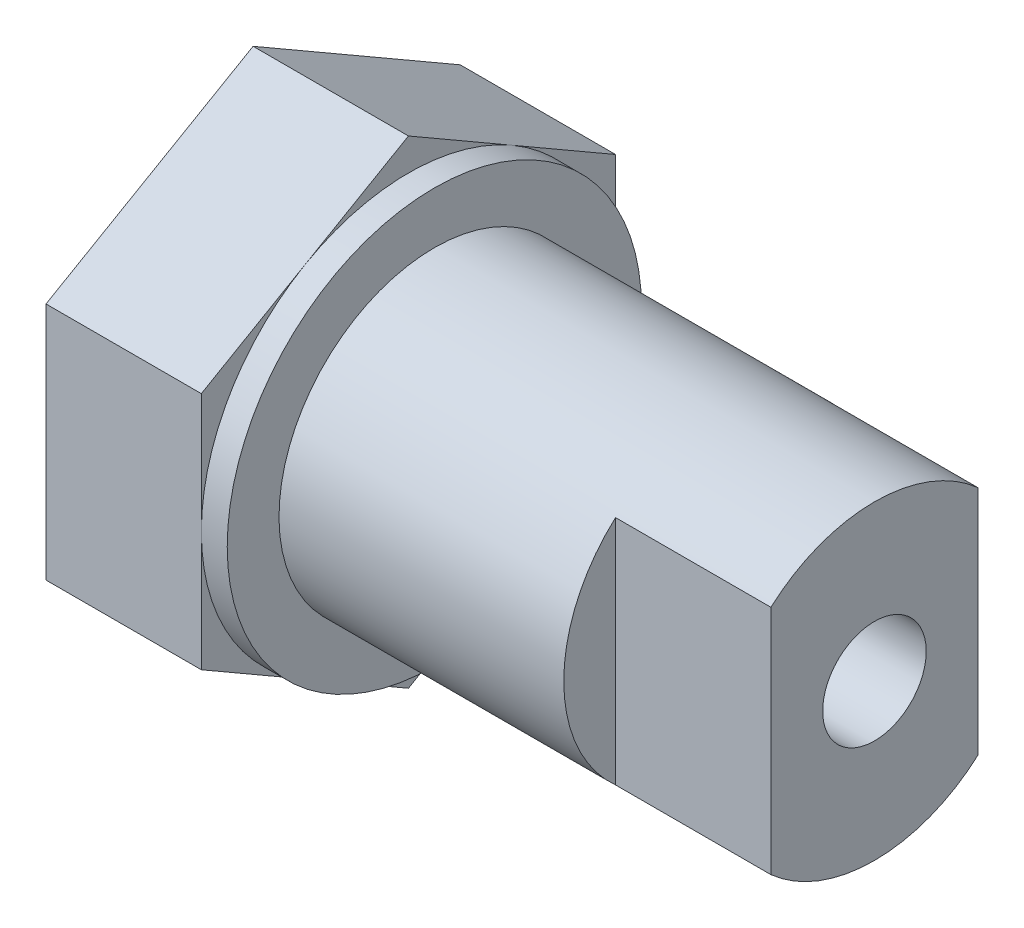
ISO-10303-21;
HEADER;
FILE_DESCRIPTION(('STEP AP214'),'2;1');
FILE_NAME('part.step','',(''),(''),'','','');
FILE_SCHEMA(('AUTOMOTIVE_DESIGN { 1 0 10303 214 1 1 1 1 }'));
ENDSEC;
DATA;
#1=APPLICATION_CONTEXT('core data for automotive mechanical design processes');
#2=APPLICATION_PROTOCOL_DEFINITION('international standard','automotive_design',2000,#1);
#3=PRODUCT_CONTEXT('',#1,'mechanical');
#4=PRODUCT('Part','Part','',(#3));
#5=PRODUCT_RELATED_PRODUCT_CATEGORY('part','',(#4));
#6=PRODUCT_DEFINITION_FORMATION('','',#4);
#7=PRODUCT_DEFINITION_CONTEXT('part definition',#1,'design');
#8=PRODUCT_DEFINITION('design','',#6,#7);
#9=PRODUCT_DEFINITION_SHAPE('','',#8);
#10=(LENGTH_UNIT() NAMED_UNIT(*) SI_UNIT(.MILLI.,.METRE.));
#11=(NAMED_UNIT(*) PLANE_ANGLE_UNIT() SI_UNIT($,.RADIAN.));
#12=(NAMED_UNIT(*) SI_UNIT($,.STERADIAN.) SOLID_ANGLE_UNIT());
#13=UNCERTAINTY_MEASURE_WITH_UNIT(LENGTH_MEASURE(1.E-05),#10,'distance_accuracy_value','');
#14=(GEOMETRIC_REPRESENTATION_CONTEXT(3) GLOBAL_UNCERTAINTY_ASSIGNED_CONTEXT((#13)) GLOBAL_UNIT_ASSIGNED_CONTEXT((#10,
#11,#12)) REPRESENTATION_CONTEXT('',''));
#15=CARTESIAN_POINT('',(0.,0.,0.));
#16=DIRECTION('',(0.,0.,1.));
#17=DIRECTION('',(1.,0.,0.));
#18=AXIS2_PLACEMENT_3D('',#15,#16,#17);
#19=CARTESIAN_POINT('',(114.3,0.,0.));
#20=DIRECTION('',(-1.,0.,0.));
#21=DIRECTION('',(0.,0.,1.));
#22=AXIS2_PLACEMENT_3D('',#19,#20,#21);
#23=CYLINDRICAL_SURFACE('',#22,38.1);
#24=CARTESIAN_POINT('',(6.35,0.,0.));
#25=DIRECTION('',(1.,0.,0.));
#26=DIRECTION('',(0.,0.,-1.));
#27=AXIS2_PLACEMENT_3D('',#24,#25,#26);
#28=CIRCLE('',#27,38.1);
#29=CARTESIAN_POINT('',(6.35,0.,-38.1));
#30=VERTEX_POINT('',#29);
#31=EDGE_CURVE('E11',#30,#30,#28,.T.);
#32=ORIENTED_EDGE('',*,*,#31,.T.);
#33=EDGE_LOOP('',(#32));
#34=FACE_BOUND('',#33,.T.);
#35=DIRECTION('',(1.,0.,0.));
#36=VECTOR('',#35,1.);
#37=CARTESIAN_POINT('',(76.2,28.3980633142473,25.4));
#38=LINE('',#37,#36);
#39=CARTESIAN_POINT('',(76.2,28.3980633142473,25.4));
#40=VERTEX_POINT('',#39);
#41=CARTESIAN_POINT('',(114.3,28.3980633142473,25.4));
#42=VERTEX_POINT('',#41);
#43=EDGE_CURVE('E134',#40,#42,#38,.T.);
#44=ORIENTED_EDGE('',*,*,#43,.T.);
#45=CARTESIAN_POINT('',(114.3,0.,0.));
#46=DIRECTION('',(1.,0.,0.));
#47=DIRECTION('',(0.,0.,-1.));
#48=AXIS2_PLACEMENT_3D('',#45,#46,#47);
#49=CIRCLE('',#48,38.1);
#50=CARTESIAN_POINT('',(114.3,28.3980633142473,-25.4));
#51=VERTEX_POINT('',#50);
#52=EDGE_CURVE('E172',#51,#42,#49,.T.);
#53=ORIENTED_EDGE('',*,*,#52,.F.);
#54=DIRECTION('',(1.,0.,0.));
#55=VECTOR('',#54,1.);
#56=CARTESIAN_POINT('',(76.2,28.3980633142473,-25.4));
#57=LINE('',#56,#55);
#58=CARTESIAN_POINT('',(76.2,28.3980633142473,-25.4));
#59=VERTEX_POINT('',#58);
#60=EDGE_CURVE('E63',#59,#51,#57,.T.);
#61=ORIENTED_EDGE('',*,*,#60,.F.);
#62=CARTESIAN_POINT('',(76.2,0.,0.));
#63=DIRECTION('',(1.,0.,0.));
#64=DIRECTION('',(0.,0.,-1.));
#65=AXIS2_PLACEMENT_3D('',#62,#63,#64);
#66=CIRCLE('',#65,38.1);
#67=CARTESIAN_POINT('',(76.2,-28.3980633142473,-25.4));
#68=VERTEX_POINT('',#67);
#69=EDGE_CURVE('E156',#68,#59,#66,.T.);
#70=ORIENTED_EDGE('',*,*,#69,.F.);
#71=DIRECTION('',(1.,0.,0.));
#72=VECTOR('',#71,1.);
#73=CARTESIAN_POINT('',(76.2,-28.3980633142473,-25.4));
#74=LINE('',#73,#72);
#75=CARTESIAN_POINT('',(114.3,-28.3980633142473,-25.4));
#76=VERTEX_POINT('',#75);
#77=EDGE_CURVE('E153',#68,#76,#74,.T.);
#78=ORIENTED_EDGE('',*,*,#77,.T.);
#79=CARTESIAN_POINT('',(114.3,-28.3980633142473,25.4));
#80=VERTEX_POINT('',#79);
#81=EDGE_CURVE('E169',#80,#76,#49,.T.);
#82=ORIENTED_EDGE('',*,*,#81,.F.);
#83=DIRECTION('',(1.,0.,0.));
#84=VECTOR('',#83,1.);
#85=CARTESIAN_POINT('',(76.2,-28.3980633142473,25.4));
#86=LINE('',#85,#84);
#87=CARTESIAN_POINT('',(76.2,-28.3980633142473,25.4));
#88=VERTEX_POINT('',#87);
#89=EDGE_CURVE('E55',#88,#80,#86,.T.);
#90=ORIENTED_EDGE('',*,*,#89,.F.);
#91=CARTESIAN_POINT('',(76.2,0.,0.));
#92=DIRECTION('',(1.,0.,0.));
#93=DIRECTION('',(0.,0.,-1.));
#94=AXIS2_PLACEMENT_3D('',#91,#92,#93);
#95=CIRCLE('',#94,38.1);
#96=EDGE_CURVE('E144',#40,#88,#95,.T.);
#97=ORIENTED_EDGE('',*,*,#96,.F.);
#98=EDGE_LOOP('',(#44,#53,#61,#70,#78,#82,#90,#97));
#99=FACE_BOUND('',#98,.T.);
#100=ADVANCED_FACE('F38',(#34,#99),#23,.T.);
#101=CARTESIAN_POINT('',(114.3,0.,0.));
#102=DIRECTION('',(1.,0.,0.));
#103=DIRECTION('',(0.,0.,-1.));
#104=AXIS2_PLACEMENT_3D('',#101,#102,#103);
#105=PLANE('',#104);
#106=CARTESIAN_POINT('',(114.3,0.,0.));
#107=DIRECTION('',(1.,0.,0.));
#108=DIRECTION('',(0.,0.,-1.));
#109=AXIS2_PLACEMENT_3D('',#106,#107,#108);
#110=CIRCLE('',#109,12.7);
#111=CARTESIAN_POINT('',(114.3,0.,-12.7));
#112=VERTEX_POINT('',#111);
#113=EDGE_CURVE('E154',#112,#112,#110,.T.);
#114=ORIENTED_EDGE('',*,*,#113,.F.);
#115=EDGE_LOOP('',(#114));
#116=FACE_BOUND('',#115,.T.);
#117=ORIENTED_EDGE('',*,*,#52,.T.);
#118=DIRECTION('',(0.,-1.,0.));
#119=VECTOR('',#118,1.);
#120=CARTESIAN_POINT('',(114.3,0.,25.4));
#121=LINE('',#120,#119);
#122=EDGE_CURVE('E139',#42,#80,#121,.T.);
#123=ORIENTED_EDGE('',*,*,#122,.T.);
#124=ORIENTED_EDGE('',*,*,#81,.T.);
#125=DIRECTION('',(0.,-1.,0.));
#126=VECTOR('',#125,1.);
#127=CARTESIAN_POINT('',(114.3,0.,-25.4));
#128=LINE('',#127,#126);
#129=EDGE_CURVE('E159',#51,#76,#128,.T.);
#130=ORIENTED_EDGE('',*,*,#129,.F.);
#131=EDGE_LOOP('',(#117,#123,#124,#130));
#132=FACE_BOUND('',#131,.T.);
#133=ADVANCED_FACE('F282',(#116,#132),#105,.T.);
#134=CARTESIAN_POINT('',(0.,0.,0.));
#135=DIRECTION('',(1.,0.,0.));
#136=DIRECTION('',(0.,0.,-1.));
#137=AXIS2_PLACEMENT_3D('',#134,#135,#136);
#138=PLANE('',#137);
#139=CARTESIAN_POINT('',(0.,0.,0.));
#140=DIRECTION('',(1.,0.,0.));
#141=DIRECTION('',(0.,0.,-1.));
#142=AXIS2_PLACEMENT_3D('',#139,#140,#141);
#143=CIRCLE('',#142,50.8);
#144=CARTESIAN_POINT('',(0.,0.,-50.8));
#145=VERTEX_POINT('',#144);
#146=CARTESIAN_POINT('',(0.,43.9940905122495,-25.4));
#147=VERTEX_POINT('',#146);
#148=EDGE_CURVE('E173',#145,#147,#143,.T.);
#149=ORIENTED_EDGE('',*,*,#148,.F.);
#150=DIRECTION('',(0.,1.,0.));
#151=VECTOR('',#150,1.);
#152=CARTESIAN_POINT('',(0.,0.,-50.8));
#153=LINE('',#152,#151);
#154=CARTESIAN_POINT('',(0.,29.329393674833,-50.8));
#155=VERTEX_POINT('',#154);
#156=EDGE_CURVE('E212',#145,#155,#153,.T.);
#157=ORIENTED_EDGE('',*,*,#156,.T.);
#158=DIRECTION('',(0.,0.5,0.866025403784438));
#159=VECTOR('',#158,1.);
#160=CARTESIAN_POINT('',(0.,43.9940905122495,-25.4));
#161=LINE('',#160,#159);
#162=EDGE_CURVE('E216',#155,#147,#161,.T.);
#163=ORIENTED_EDGE('',*,*,#162,.T.);
#164=EDGE_LOOP('',(#149,#157,#163));
#165=FACE_BOUND('',#164,.T.);
#166=ADVANCED_FACE('F280',(#165),#138,.T.);
#167=CARTESIAN_POINT('',(0.,43.9940905122495,25.4));
#168=VERTEX_POINT('',#167);
#169=EDGE_CURVE('E47',#147,#168,#143,.T.);
#170=ORIENTED_EDGE('',*,*,#169,.F.);
#171=CARTESIAN_POINT('',(0.,58.658787349666,0.));
#172=VERTEX_POINT('',#171);
#173=EDGE_CURVE('E215',#147,#172,#161,.T.);
#174=ORIENTED_EDGE('',*,*,#173,.T.);
#175=DIRECTION('',(0.,-0.499999999999999,0.866025403784439));
#176=VECTOR('',#175,1.);
#177=CARTESIAN_POINT('',(0.,43.9940905122495,25.4));
#178=LINE('',#177,#176);
#179=EDGE_CURVE('E186',#172,#168,#178,.T.);
#180=ORIENTED_EDGE('',*,*,#179,.T.);
#181=EDGE_LOOP('',(#170,#174,#180));
#182=FACE_BOUND('',#181,.T.);
#183=ADVANCED_FACE('F321',(#182),#138,.T.);
#184=CARTESIAN_POINT('',(0.,0.,50.8));
#185=VERTEX_POINT('',#184);
#186=EDGE_CURVE('E257',#168,#185,#143,.T.);
#187=ORIENTED_EDGE('',*,*,#186,.F.);
#188=CARTESIAN_POINT('',(0.,29.3293936748331,50.8));
#189=VERTEX_POINT('',#188);
#190=EDGE_CURVE('E219',#168,#189,#178,.T.);
#191=ORIENTED_EDGE('',*,*,#190,.T.);
#192=DIRECTION('',(0.,-1.,0.));
#193=VECTOR('',#192,1.);
#194=CARTESIAN_POINT('',(0.,0.,50.8));
#195=LINE('',#194,#193);
#196=EDGE_CURVE('E201',#189,#185,#195,.T.);
#197=ORIENTED_EDGE('',*,*,#196,.T.);
#198=EDGE_LOOP('',(#187,#191,#197));
#199=FACE_BOUND('',#198,.T.);
#200=ADVANCED_FACE('F275',(#199),#138,.T.);
#201=CARTESIAN_POINT('',(0.,-43.9940905122495,25.4));
#202=VERTEX_POINT('',#201);
#203=EDGE_CURVE('E249',#185,#202,#143,.T.);
#204=ORIENTED_EDGE('',*,*,#203,.F.);
#205=CARTESIAN_POINT('',(0.,-29.329393674833,50.8));
#206=VERTEX_POINT('',#205);
#207=EDGE_CURVE('E178',#185,#206,#195,.T.);
#208=ORIENTED_EDGE('',*,*,#207,.T.);
#209=DIRECTION('',(0.,-0.500000000000001,-0.866025403784438));
#210=VECTOR('',#209,1.);
#211=CARTESIAN_POINT('',(0.,-43.9940905122495,25.4));
#212=LINE('',#211,#210);
#213=EDGE_CURVE('E205',#206,#202,#212,.T.);
#214=ORIENTED_EDGE('',*,*,#213,.T.);
#215=EDGE_LOOP('',(#204,#208,#214));
#216=FACE_BOUND('',#215,.T.);
#217=ADVANCED_FACE('F248',(#216),#138,.T.);
#218=CARTESIAN_POINT('',(0.,-43.9940905122495,-25.4));
#219=VERTEX_POINT('',#218);
#220=EDGE_CURVE('E255',#202,#219,#143,.T.);
#221=ORIENTED_EDGE('',*,*,#220,.F.);
#222=CARTESIAN_POINT('',(0.,-58.658787349666,0.));
#223=VERTEX_POINT('',#222);
#224=EDGE_CURVE('E204',#202,#223,#212,.T.);
#225=ORIENTED_EDGE('',*,*,#224,.T.);
#226=DIRECTION('',(0.,0.499999999999999,-0.866025403784439));
#227=VECTOR('',#226,1.);
#228=CARTESIAN_POINT('',(0.,-43.9940905122495,-25.4));
#229=LINE('',#228,#227);
#230=EDGE_CURVE('E209',#223,#219,#229,.T.);
#231=ORIENTED_EDGE('',*,*,#230,.T.);
#232=EDGE_LOOP('',(#221,#225,#231));
#233=FACE_BOUND('',#232,.T.);
#234=ADVANCED_FACE('F267',(#233),#138,.T.);
#235=CARTESIAN_POINT('',(-38.1,0.,50.8));
#236=DIRECTION('',(0.,0.,1.));
#237=DIRECTION('',(0.,-1.,0.));
#238=AXIS2_PLACEMENT_3D('',#235,#236,#237);
#239=PLANE('',#238);
#240=ORIENTED_EDGE('',*,*,#196,.F.);
#241=DIRECTION('',(1.,0.,0.));
#242=VECTOR('',#241,1.);
#243=CARTESIAN_POINT('',(-38.1,29.3293936748331,50.8));
#244=LINE('',#243,#242);
#245=CARTESIAN_POINT('',(-38.1,29.3293936748331,50.8));
#246=VERTEX_POINT('',#245);
#247=EDGE_CURVE('E222',#246,#189,#244,.T.);
#248=ORIENTED_EDGE('',*,*,#247,.F.);
#249=DIRECTION('',(0.,-1.,0.));
#250=VECTOR('',#249,1.);
#251=CARTESIAN_POINT('',(-38.1,0.,50.8));
#252=LINE('',#251,#250);
#253=CARTESIAN_POINT('',(-38.1,-29.329393674833,50.8));
#254=VERTEX_POINT('',#253);
#255=EDGE_CURVE('E182',#246,#254,#252,.T.);
#256=ORIENTED_EDGE('',*,*,#255,.T.);
#257=DIRECTION('',(1.,0.,0.));
#258=VECTOR('',#257,1.);
#259=CARTESIAN_POINT('',(-38.1,-29.329393674833,50.8));
#260=LINE('',#259,#258);
#261=EDGE_CURVE('E42',#254,#206,#260,.T.);
#262=ORIENTED_EDGE('',*,*,#261,.T.);
#263=ORIENTED_EDGE('',*,*,#207,.F.);
#264=EDGE_LOOP('',(#240,#248,#256,#262,#263));
#265=FACE_BOUND('',#264,.T.);
#266=ADVANCED_FACE('F40',(#265),#239,.T.);
#267=CARTESIAN_POINT('',(-38.1,43.9940905122495,25.4));
#268=DIRECTION('',(0.,0.866025403784439,0.499999999999999));
#269=DIRECTION('',(0.,-0.499999999999999,0.866025403784439));
#270=AXIS2_PLACEMENT_3D('',#267,#268,#269);
#271=PLANE('',#270);
#272=ORIENTED_EDGE('',*,*,#179,.F.);
#273=DIRECTION('',(1.,0.,0.));
#274=VECTOR('',#273,1.);
#275=CARTESIAN_POINT('',(-38.1,58.658787349666,0.));
#276=LINE('',#275,#274);
#277=CARTESIAN_POINT('',(-38.1,58.658787349666,0.));
#278=VERTEX_POINT('',#277);
#279=EDGE_CURVE('E225',#278,#172,#276,.T.);
#280=ORIENTED_EDGE('',*,*,#279,.F.);
#281=DIRECTION('',(0.,-0.499999999999999,0.866025403784439));
#282=VECTOR('',#281,1.);
#283=CARTESIAN_POINT('',(-38.1,43.9940905122495,25.4));
#284=LINE('',#283,#282);
#285=EDGE_CURVE('E198',#278,#246,#284,.T.);
#286=ORIENTED_EDGE('',*,*,#285,.T.);
#287=ORIENTED_EDGE('',*,*,#247,.T.);
#288=ORIENTED_EDGE('',*,*,#190,.F.);
#289=EDGE_LOOP('',(#272,#280,#286,#287,#288));
#290=FACE_BOUND('',#289,.T.);
#291=ADVANCED_FACE('F274',(#290),#271,.T.);
#292=CARTESIAN_POINT('',(-38.1,43.9940905122495,-25.4));
#293=DIRECTION('',(0.,0.866025403784438,-0.5));
#294=DIRECTION('',(0.,0.5,0.866025403784438));
#295=AXIS2_PLACEMENT_3D('',#292,#293,#294);
#296=PLANE('',#295);
#297=ORIENTED_EDGE('',*,*,#162,.F.);
#298=DIRECTION('',(1.,0.,0.));
#299=VECTOR('',#298,1.);
#300=CARTESIAN_POINT('',(-38.1,29.329393674833,-50.8));
#301=LINE('',#300,#299);
#302=CARTESIAN_POINT('',(-38.1,29.329393674833,-50.8));
#303=VERTEX_POINT('',#302);
#304=EDGE_CURVE('E228',#303,#155,#301,.T.);
#305=ORIENTED_EDGE('',*,*,#304,.F.);
#306=DIRECTION('',(0.,0.5,0.866025403784438));
#307=VECTOR('',#306,1.);
#308=CARTESIAN_POINT('',(-38.1,43.9940905122495,-25.4));
#309=LINE('',#308,#307);
#310=EDGE_CURVE('E195',#303,#278,#309,.T.);
#311=ORIENTED_EDGE('',*,*,#310,.T.);
#312=ORIENTED_EDGE('',*,*,#279,.T.);
#313=ORIENTED_EDGE('',*,*,#173,.F.);
#314=EDGE_LOOP('',(#297,#305,#311,#312,#313));
#315=FACE_BOUND('',#314,.T.);
#316=ADVANCED_FACE('F315',(#315),#296,.T.);
#317=CARTESIAN_POINT('',(-38.1,0.,-50.8));
#318=DIRECTION('',(0.,0.,-1.));
#319=DIRECTION('',(0.,1.,0.));
#320=AXIS2_PLACEMENT_3D('',#317,#318,#319);
#321=PLANE('',#320);
#322=CARTESIAN_POINT('',(0.,-29.3293936748331,-50.8));
#323=VERTEX_POINT('',#322);
#324=EDGE_CURVE('E213',#323,#145,#153,.T.);
#325=ORIENTED_EDGE('',*,*,#324,.F.);
#326=DIRECTION('',(1.,0.,0.));
#327=VECTOR('',#326,1.);
#328=CARTESIAN_POINT('',(-38.1,-29.3293936748331,-50.8));
#329=LINE('',#328,#327);
#330=CARTESIAN_POINT('',(-38.1,-29.3293936748331,-50.8));
#331=VERTEX_POINT('',#330);
#332=EDGE_CURVE('E231',#331,#323,#329,.T.);
#333=ORIENTED_EDGE('',*,*,#332,.F.);
#334=DIRECTION('',(0.,1.,0.));
#335=VECTOR('',#334,1.);
#336=CARTESIAN_POINT('',(-38.1,0.,-50.8));
#337=LINE('',#336,#335);
#338=EDGE_CURVE('E192',#331,#303,#337,.T.);
#339=ORIENTED_EDGE('',*,*,#338,.T.);
#340=ORIENTED_EDGE('',*,*,#304,.T.);
#341=ORIENTED_EDGE('',*,*,#156,.F.);
#342=EDGE_LOOP('',(#325,#333,#339,#340,#341));
#343=FACE_BOUND('',#342,.T.);
#344=ADVANCED_FACE('F318',(#343),#321,.T.);
#345=CARTESIAN_POINT('',(-38.1,-43.9940905122495,-25.4));
#346=DIRECTION('',(0.,-0.866025403784439,-0.499999999999999));
#347=DIRECTION('',(0.,0.499999999999999,-0.866025403784439));
#348=AXIS2_PLACEMENT_3D('',#345,#346,#347);
#349=PLANE('',#348);
#350=ORIENTED_EDGE('',*,*,#230,.F.);
#351=DIRECTION('',(1.,0.,0.));
#352=VECTOR('',#351,1.);
#353=CARTESIAN_POINT('',(-38.1,-58.658787349666,0.));
#354=LINE('',#353,#352);
#355=CARTESIAN_POINT('',(-38.1,-58.658787349666,0.));
#356=VERTEX_POINT('',#355);
#357=EDGE_CURVE('E233',#356,#223,#354,.T.);
#358=ORIENTED_EDGE('',*,*,#357,.F.);
#359=DIRECTION('',(0.,0.499999999999999,-0.866025403784439));
#360=VECTOR('',#359,1.);
#361=CARTESIAN_POINT('',(-38.1,-43.9940905122495,-25.4));
#362=LINE('',#361,#360);
#363=EDGE_CURVE('E189',#356,#331,#362,.T.);
#364=ORIENTED_EDGE('',*,*,#363,.T.);
#365=ORIENTED_EDGE('',*,*,#332,.T.);
#366=EDGE_CURVE('E208',#219,#323,#229,.T.);
#367=ORIENTED_EDGE('',*,*,#366,.F.);
#368=EDGE_LOOP('',(#350,#358,#364,#365,#367));
#369=FACE_BOUND('',#368,.T.);
#370=ADVANCED_FACE('F265',(#369),#349,.T.);
#371=CARTESIAN_POINT('',(-38.1,-43.9940905122495,25.4));
#372=DIRECTION('',(0.,-0.866025403784438,0.500000000000001));
#373=DIRECTION('',(0.,-0.500000000000001,-0.866025403784438));
#374=AXIS2_PLACEMENT_3D('',#371,#372,#373);
#375=PLANE('',#374);
#376=ORIENTED_EDGE('',*,*,#213,.F.);
#377=ORIENTED_EDGE('',*,*,#261,.F.);
#378=DIRECTION('',(0.,-0.500000000000001,-0.866025403784438));
#379=VECTOR('',#378,1.);
#380=CARTESIAN_POINT('',(-38.1,-43.9940905122495,25.4));
#381=LINE('',#380,#379);
#382=EDGE_CURVE('E185',#254,#356,#381,.T.);
#383=ORIENTED_EDGE('',*,*,#382,.T.);
#384=ORIENTED_EDGE('',*,*,#357,.T.);
#385=ORIENTED_EDGE('',*,*,#224,.F.);
#386=EDGE_LOOP('',(#376,#377,#383,#384,#385));
#387=FACE_BOUND('',#386,.T.);
#388=ADVANCED_FACE('F245',(#387),#375,.T.);
#389=CARTESIAN_POINT('',(-38.1,0.,0.));
#390=DIRECTION('',(1.,0.,0.));
#391=DIRECTION('',(0.,0.,-1.));
#392=AXIS2_PLACEMENT_3D('',#389,#390,#391);
#393=PLANE('',#392);
#394=CARTESIAN_POINT('',(-38.1,0.,0.));
#395=DIRECTION('',(1.,0.,0.));
#396=DIRECTION('',(0.,0.,-1.));
#397=AXIS2_PLACEMENT_3D('',#394,#395,#396);
#398=CIRCLE('',#397,12.7);
#399=CARTESIAN_POINT('',(-38.1,0.,-12.7));
#400=VERTEX_POINT('',#399);
#401=EDGE_CURVE('E166',#400,#400,#398,.T.);
#402=ORIENTED_EDGE('',*,*,#401,.T.);
#403=EDGE_LOOP('',(#402));
#404=FACE_BOUND('',#403,.T.);
#405=ORIENTED_EDGE('',*,*,#255,.F.);
#406=ORIENTED_EDGE('',*,*,#285,.F.);
#407=ORIENTED_EDGE('',*,*,#310,.F.);
#408=ORIENTED_EDGE('',*,*,#338,.F.);
#409=ORIENTED_EDGE('',*,*,#363,.F.);
#410=ORIENTED_EDGE('',*,*,#382,.F.);
#411=EDGE_LOOP('',(#405,#406,#407,#408,#409,#410));
#412=FACE_BOUND('',#411,.T.);
#413=ADVANCED_FACE('F279',(#404,#412),#393,.F.);
#414=EDGE_CURVE('E181',#219,#145,#143,.T.);
#415=ORIENTED_EDGE('',*,*,#414,.F.);
#416=ORIENTED_EDGE('',*,*,#366,.T.);
#417=ORIENTED_EDGE('',*,*,#324,.T.);
#418=EDGE_LOOP('',(#415,#416,#417));
#419=FACE_BOUND('',#418,.T.);
#420=ADVANCED_FACE('F261',(#419),#138,.T.);
#421=CARTESIAN_POINT('',(6.35,0.,0.));
#422=DIRECTION('',(-1.,0.,0.));
#423=DIRECTION('',(0.,0.,1.));
#424=AXIS2_PLACEMENT_3D('',#421,#422,#423);
#425=CYLINDRICAL_SURFACE('',#424,50.8);
#426=CARTESIAN_POINT('',(6.35,0.,0.));
#427=DIRECTION('',(1.,0.,0.));
#428=DIRECTION('',(0.,0.,-1.));
#429=AXIS2_PLACEMENT_3D('',#426,#427,#428);
#430=CIRCLE('',#429,50.8);
#431=CARTESIAN_POINT('',(6.35,0.,-50.8));
#432=VERTEX_POINT('',#431);
#433=EDGE_CURVE('E175',#432,#432,#430,.T.);
#434=ORIENTED_EDGE('',*,*,#433,.F.);
#435=EDGE_LOOP('',(#434));
#436=FACE_BOUND('',#435,.T.);
#437=ORIENTED_EDGE('',*,*,#148,.T.);
#438=ORIENTED_EDGE('',*,*,#169,.T.);
#439=ORIENTED_EDGE('',*,*,#186,.T.);
#440=ORIENTED_EDGE('',*,*,#203,.T.);
#441=ORIENTED_EDGE('',*,*,#220,.T.);
#442=ORIENTED_EDGE('',*,*,#414,.T.);
#443=EDGE_LOOP('',(#437,#438,#439,#440,#441,#442));
#444=FACE_BOUND('',#443,.T.);
#445=ADVANCED_FACE('F253',(#436,#444),#425,.T.);
#446=CARTESIAN_POINT('',(6.35,0.,0.));
#447=DIRECTION('',(1.,0.,0.));
#448=DIRECTION('',(0.,0.,-1.));
#449=AXIS2_PLACEMENT_3D('',#446,#447,#448);
#450=PLANE('',#449);
#451=ORIENTED_EDGE('',*,*,#31,.F.);
#452=EDGE_LOOP('',(#451));
#453=FACE_BOUND('',#452,.T.);
#454=ORIENTED_EDGE('',*,*,#433,.T.);
#455=EDGE_LOOP('',(#454));
#456=FACE_BOUND('',#455,.T.);
#457=ADVANCED_FACE('F292',(#453,#456),#450,.T.);
#458=CARTESIAN_POINT('',(-38.1,0.,0.));
#459=DIRECTION('',(1.,0.,0.));
#460=DIRECTION('',(0.,0.,-1.));
#461=AXIS2_PLACEMENT_3D('',#458,#459,#460);
#462=CYLINDRICAL_SURFACE('',#461,12.7);
#463=ORIENTED_EDGE('',*,*,#401,.F.);
#464=EDGE_LOOP('',(#463));
#465=FACE_BOUND('',#464,.T.);
#466=ORIENTED_EDGE('',*,*,#113,.T.);
#467=EDGE_LOOP('',(#466));
#468=FACE_BOUND('',#467,.T.);
#469=ADVANCED_FACE('F295',(#465,#468),#462,.F.);
#470=CARTESIAN_POINT('',(76.2,0.,-25.4));
#471=DIRECTION('',(0.,0.,1.));
#472=DIRECTION('',(1.,0.,0.));
#473=AXIS2_PLACEMENT_3D('',#470,#471,#472);
#474=PLANE('',#473);
#475=ORIENTED_EDGE('',*,*,#129,.T.);
#476=ORIENTED_EDGE('',*,*,#77,.F.);
#477=DIRECTION('',(0.,-1.,0.));
#478=VECTOR('',#477,1.);
#479=CARTESIAN_POINT('',(76.2,0.,-25.4));
#480=LINE('',#479,#478);
#481=EDGE_CURVE('E158',#59,#68,#480,.T.);
#482=ORIENTED_EDGE('',*,*,#481,.F.);
#483=ORIENTED_EDGE('',*,*,#60,.T.);
#484=EDGE_LOOP('',(#475,#476,#482,#483));
#485=FACE_BOUND('',#484,.T.);
#486=ADVANCED_FACE('F343',(#485),#474,.F.);
#487=CARTESIAN_POINT('',(76.2,0.,0.));
#488=DIRECTION('',(1.,0.,0.));
#489=DIRECTION('',(0.,0.,-1.));
#490=AXIS2_PLACEMENT_3D('',#487,#488,#489);
#491=PLANE('',#490);
#492=ORIENTED_EDGE('',*,*,#69,.T.);
#493=ORIENTED_EDGE('',*,*,#481,.T.);
#494=EDGE_LOOP('',(#492,#493));
#495=FACE_BOUND('',#494,.T.);
#496=ADVANCED_FACE('F348',(#495),#491,.T.);
#497=CARTESIAN_POINT('',(76.2,0.,25.4));
#498=DIRECTION('',(0.,0.,1.));
#499=DIRECTION('',(1.,0.,0.));
#500=AXIS2_PLACEMENT_3D('',#497,#498,#499);
#501=PLANE('',#500);
#502=ORIENTED_EDGE('',*,*,#122,.F.);
#503=ORIENTED_EDGE('',*,*,#43,.F.);
#504=DIRECTION('',(0.,-1.,0.));
#505=VECTOR('',#504,1.);
#506=CARTESIAN_POINT('',(76.2,0.,25.4));
#507=LINE('',#506,#505);
#508=EDGE_CURVE('E137',#40,#88,#507,.T.);
#509=ORIENTED_EDGE('',*,*,#508,.T.);
#510=ORIENTED_EDGE('',*,*,#89,.T.);
#511=EDGE_LOOP('',(#502,#503,#509,#510));
#512=FACE_BOUND('',#511,.T.);
#513=ADVANCED_FACE('F136',(#512),#501,.T.);
#514=CARTESIAN_POINT('',(76.2,0.,0.));
#515=DIRECTION('',(1.,0.,0.));
#516=DIRECTION('',(0.,0.,-1.));
#517=AXIS2_PLACEMENT_3D('',#514,#515,#516);
#518=PLANE('',#517);
#519=ORIENTED_EDGE('',*,*,#508,.F.);
#520=ORIENTED_EDGE('',*,*,#96,.T.);
#521=EDGE_LOOP('',(#519,#520));
#522=FACE_BOUND('',#521,.T.);
#523=ADVANCED_FACE('F147',(#522),#518,.T.);
#524=CLOSED_SHELL('',(#100,#133,#166,#183,#200,#217,#234,#266,#291,#316,#344,#370,#388,#413,
#420,#445,#457,#469,#486,#496,#513,#523));
#525=MANIFOLD_SOLID_BREP('B2',#524);
#526=ADVANCED_BREP_SHAPE_REPRESENTATION('',(#18,#525),#14);
#527=SHAPE_DEFINITION_REPRESENTATION(#9,#526);
ENDSEC;
END-ISO-10303-21;
